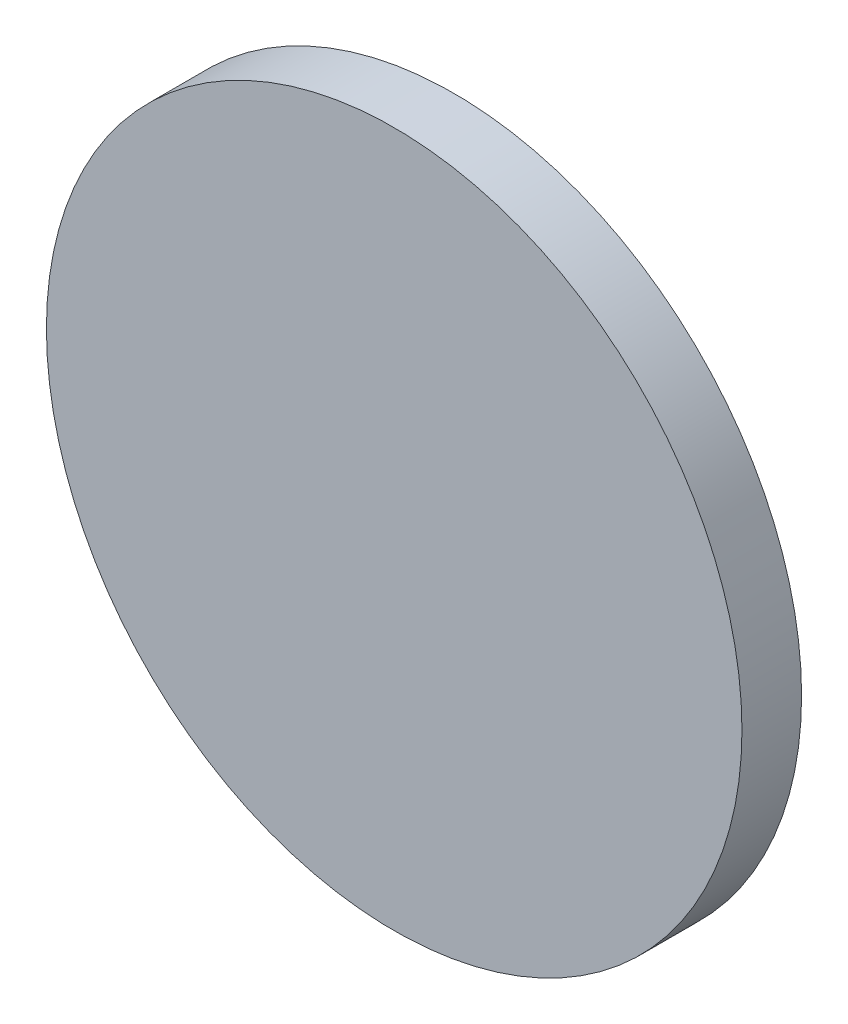
ISO-10303-21;
HEADER;
FILE_DESCRIPTION(('STEP AP214'),'2;1');
FILE_NAME('part.step','',(''),(''),'','','');
FILE_SCHEMA(('AUTOMOTIVE_DESIGN { 1 0 10303 214 1 1 1 1 }'));
ENDSEC;
DATA;
#1=APPLICATION_CONTEXT('core data for automotive mechanical design processes');
#2=APPLICATION_PROTOCOL_DEFINITION('international standard','automotive_design',2000,#1);
#3=PRODUCT_CONTEXT('',#1,'mechanical');
#4=PRODUCT('Part','Part','',(#3));
#5=PRODUCT_RELATED_PRODUCT_CATEGORY('part','',(#4));
#6=PRODUCT_DEFINITION_FORMATION('','',#4);
#7=PRODUCT_DEFINITION_CONTEXT('part definition',#1,'design');
#8=PRODUCT_DEFINITION('design','',#6,#7);
#9=PRODUCT_DEFINITION_SHAPE('','',#8);
#10=(LENGTH_UNIT() NAMED_UNIT(*) SI_UNIT(.MILLI.,.METRE.));
#11=(NAMED_UNIT(*) PLANE_ANGLE_UNIT() SI_UNIT($,.RADIAN.));
#12=(NAMED_UNIT(*) SI_UNIT($,.STERADIAN.) SOLID_ANGLE_UNIT());
#13=UNCERTAINTY_MEASURE_WITH_UNIT(LENGTH_MEASURE(1.E-05),#10,'distance_accuracy_value','');
#14=(GEOMETRIC_REPRESENTATION_CONTEXT(3) GLOBAL_UNCERTAINTY_ASSIGNED_CONTEXT((#13)) GLOBAL_UNIT_ASSIGNED_CONTEXT((#10,
#11,#12)) REPRESENTATION_CONTEXT('',''));
#15=CARTESIAN_POINT('',(0.,0.,0.));
#16=DIRECTION('',(0.,0.,1.));
#17=DIRECTION('',(1.,0.,0.));
#18=AXIS2_PLACEMENT_3D('',#15,#16,#17);
#19=CARTESIAN_POINT('',(7.328,8.839,0.));
#20=DIRECTION('',(0.,0.,-1.));
#21=DIRECTION('',(-1.,0.,0.));
#22=AXIS2_PLACEMENT_3D('',#19,#20,#21);
#23=PLANE('',#22);
#24=CARTESIAN_POINT('',(7.328,8.839,0.));
#25=DIRECTION('',(0.,0.,1.));
#26=DIRECTION('',(1.,0.,0.));
#27=AXIS2_PLACEMENT_3D('',#24,#25,#26);
#28=CIRCLE('',#27,0.200024667);
#29=CARTESIAN_POINT('',(7.528024667,8.839,0.));
#30=VERTEX_POINT('',#29);
#31=EDGE_CURVE('E18',#30,#30,#28,.T.);
#32=ORIENTED_EDGE('',*,*,#31,.F.);
#33=EDGE_LOOP('',(#32));
#34=FACE_BOUND('',#33,.T.);
#35=ADVANCED_FACE('F15',(#34),#23,.T.);
#36=CARTESIAN_POINT('',(7.328,8.839,0.));
#37=DIRECTION('',(0.,0.,1.));
#38=DIRECTION('',(1.,0.,0.));
#39=AXIS2_PLACEMENT_3D('',#36,#37,#38);
#40=CYLINDRICAL_SURFACE('',#39,0.200024667);
#41=CARTESIAN_POINT('',(7.328,8.839,0.03429));
#42=DIRECTION('',(0.,0.,1.));
#43=DIRECTION('',(1.,0.,0.));
#44=AXIS2_PLACEMENT_3D('',#41,#42,#43);
#45=CIRCLE('',#44,0.200024667);
#46=CARTESIAN_POINT('',(7.528024667,8.839,0.03429));
#47=VERTEX_POINT('',#46);
#48=EDGE_CURVE('E10',#47,#47,#45,.T.);
#49=ORIENTED_EDGE('',*,*,#48,.F.);
#50=EDGE_LOOP('',(#49));
#51=FACE_BOUND('',#50,.T.);
#52=ORIENTED_EDGE('',*,*,#31,.T.);
#53=EDGE_LOOP('',(#52));
#54=FACE_BOUND('',#53,.T.);
#55=ADVANCED_FACE('F27',(#51,#54),#40,.T.);
#56=CARTESIAN_POINT('',(7.328,8.839,0.03429));
#57=DIRECTION('',(0.,0.,1.));
#58=DIRECTION('',(1.,0.,0.));
#59=AXIS2_PLACEMENT_3D('',#56,#57,#58);
#60=PLANE('',#59);
#61=ORIENTED_EDGE('',*,*,#48,.T.);
#62=EDGE_LOOP('',(#61));
#63=FACE_BOUND('',#62,.T.);
#64=ADVANCED_FACE('F34',(#63),#60,.T.);
#65=CLOSED_SHELL('',(#35,#55,#64));
#66=MANIFOLD_SOLID_BREP('B1',#65);
#67=ADVANCED_BREP_SHAPE_REPRESENTATION('',(#18,#66),#14);
#68=SHAPE_DEFINITION_REPRESENTATION(#9,#67);
ENDSEC;
END-ISO-10303-21;
